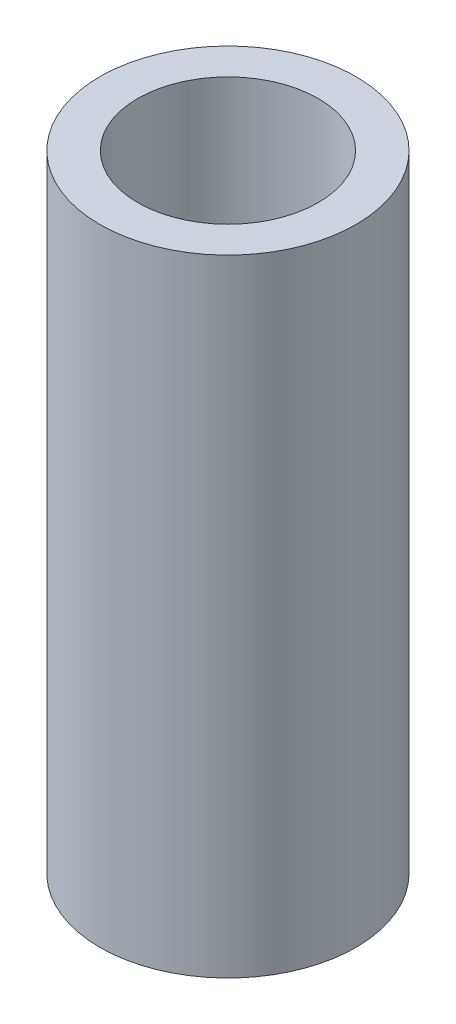
ISO-10303-21;
HEADER;
FILE_DESCRIPTION(('STEP AP214'),'2;1');
FILE_NAME('part.step','',(''),(''),'','','');
FILE_SCHEMA(('AUTOMOTIVE_DESIGN { 1 0 10303 214 1 1 1 1 }'));
ENDSEC;
DATA;
#1=APPLICATION_CONTEXT('core data for automotive mechanical design processes');
#2=APPLICATION_PROTOCOL_DEFINITION('international standard','automotive_design',2000,#1);
#3=PRODUCT_CONTEXT('',#1,'mechanical');
#4=PRODUCT('Part','Part','',(#3));
#5=PRODUCT_RELATED_PRODUCT_CATEGORY('part','',(#4));
#6=PRODUCT_DEFINITION_FORMATION('','',#4);
#7=PRODUCT_DEFINITION_CONTEXT('part definition',#1,'design');
#8=PRODUCT_DEFINITION('design','',#6,#7);
#9=PRODUCT_DEFINITION_SHAPE('','',#8);
#10=(LENGTH_UNIT() NAMED_UNIT(*) SI_UNIT(.MILLI.,.METRE.));
#11=(NAMED_UNIT(*) PLANE_ANGLE_UNIT() SI_UNIT($,.RADIAN.));
#12=(NAMED_UNIT(*) SI_UNIT($,.STERADIAN.) SOLID_ANGLE_UNIT());
#13=UNCERTAINTY_MEASURE_WITH_UNIT(LENGTH_MEASURE(1.E-05),#10,'distance_accuracy_value','');
#14=(GEOMETRIC_REPRESENTATION_CONTEXT(3) GLOBAL_UNCERTAINTY_ASSIGNED_CONTEXT((#13)) GLOBAL_UNIT_ASSIGNED_CONTEXT((#10,
#11,#12)) REPRESENTATION_CONTEXT('',''));
#15=CARTESIAN_POINT('',(0.,0.,0.));
#16=DIRECTION('',(0.,0.,1.));
#17=DIRECTION('',(1.,0.,0.));
#18=AXIS2_PLACEMENT_3D('',#15,#16,#17);
#19=CARTESIAN_POINT('',(0.,171.102827835101,0.));
#20=DIRECTION('',(0.,-1.,0.));
#21=DIRECTION('',(0.,0.,-1.));
#22=AXIS2_PLACEMENT_3D('',#19,#20,#21);
#23=CYLINDRICAL_SURFACE('',#22,35.);
#24=CARTESIAN_POINT('',(0.,171.102827835101,0.));
#25=DIRECTION('',(0.,1.,0.));
#26=DIRECTION('',(0.,0.,1.));
#27=AXIS2_PLACEMENT_3D('',#24,#25,#26);
#28=CIRCLE('',#27,35.);
#29=CARTESIAN_POINT('',(0.,171.102827835101,35.));
#30=VERTEX_POINT('',#29);
#31=EDGE_CURVE('E10',#30,#30,#28,.T.);
#32=ORIENTED_EDGE('',*,*,#31,.F.);
#33=EDGE_LOOP('',(#32));
#34=FACE_BOUND('',#33,.T.);
#35=CARTESIAN_POINT('',(0.,0.,0.));
#36=DIRECTION('',(0.,1.,0.));
#37=DIRECTION('',(0.,0.,1.));
#38=AXIS2_PLACEMENT_3D('',#35,#36,#37);
#39=CIRCLE('',#38,35.);
#40=CARTESIAN_POINT('',(0.,0.,35.));
#41=VERTEX_POINT('',#40);
#42=EDGE_CURVE('E37',#41,#41,#39,.T.);
#43=ORIENTED_EDGE('',*,*,#42,.T.);
#44=EDGE_LOOP('',(#43));
#45=FACE_BOUND('',#44,.T.);
#46=ADVANCED_FACE('F40',(#34,#45),#23,.T.);
#47=CARTESIAN_POINT('',(0.,171.102827835101,0.));
#48=DIRECTION('',(0.,1.,0.));
#49=DIRECTION('',(0.,0.,1.));
#50=AXIS2_PLACEMENT_3D('',#47,#48,#49);
#51=PLANE('',#50);
#52=CARTESIAN_POINT('',(0.,171.102827835101,0.));
#53=DIRECTION('',(0.,1.,0.));
#54=DIRECTION('',(0.,0.,1.));
#55=AXIS2_PLACEMENT_3D('',#52,#53,#54);
#56=CIRCLE('',#55,24.6686260675753);
#57=CARTESIAN_POINT('',(0.,171.102827835101,24.6686260675753));
#58=VERTEX_POINT('',#57);
#59=EDGE_CURVE('E50',#58,#58,#56,.T.);
#60=ORIENTED_EDGE('',*,*,#59,.F.);
#61=EDGE_LOOP('',(#60));
#62=FACE_BOUND('',#61,.T.);
#63=ORIENTED_EDGE('',*,*,#31,.T.);
#64=EDGE_LOOP('',(#63));
#65=FACE_BOUND('',#64,.T.);
#66=ADVANCED_FACE('F59',(#62,#65),#51,.T.);
#67=CARTESIAN_POINT('',(0.,0.,0.));
#68=DIRECTION('',(0.,1.,0.));
#69=DIRECTION('',(0.,0.,1.));
#70=AXIS2_PLACEMENT_3D('',#67,#68,#69);
#71=PLANE('',#70);
#72=CARTESIAN_POINT('',(0.,0.,0.));
#73=DIRECTION('',(0.,1.,0.));
#74=DIRECTION('',(0.,0.,1.));
#75=AXIS2_PLACEMENT_3D('',#72,#73,#74);
#76=CIRCLE('',#75,24.6686260675753);
#77=CARTESIAN_POINT('',(0.,0.,24.6686260675753));
#78=VERTEX_POINT('',#77);
#79=EDGE_CURVE('E47',#78,#78,#76,.T.);
#80=ORIENTED_EDGE('',*,*,#79,.T.);
#81=EDGE_LOOP('',(#80));
#82=FACE_BOUND('',#81,.T.);
#83=ORIENTED_EDGE('',*,*,#42,.F.);
#84=EDGE_LOOP('',(#83));
#85=FACE_BOUND('',#84,.T.);
#86=ADVANCED_FACE('F58',(#82,#85),#71,.F.);
#87=CARTESIAN_POINT('',(0.,171.102827835101,0.));
#88=DIRECTION('',(0.,-1.,0.));
#89=DIRECTION('',(0.,0.,-1.));
#90=AXIS2_PLACEMENT_3D('',#87,#88,#89);
#91=CYLINDRICAL_SURFACE('',#90,24.6686260675753);
#92=ORIENTED_EDGE('',*,*,#59,.T.);
#93=EDGE_LOOP('',(#92));
#94=FACE_BOUND('',#93,.T.);
#95=ORIENTED_EDGE('',*,*,#79,.F.);
#96=EDGE_LOOP('',(#95));
#97=FACE_BOUND('',#96,.T.);
#98=ADVANCED_FACE('F54',(#94,#97),#91,.F.);
#99=CLOSED_SHELL('',(#46,#66,#86,#98));
#100=MANIFOLD_SOLID_BREP('B2',#99);
#101=ADVANCED_BREP_SHAPE_REPRESENTATION('',(#18,#100),#14);
#102=SHAPE_DEFINITION_REPRESENTATION(#9,#101);
ENDSEC;
END-ISO-10303-21;
